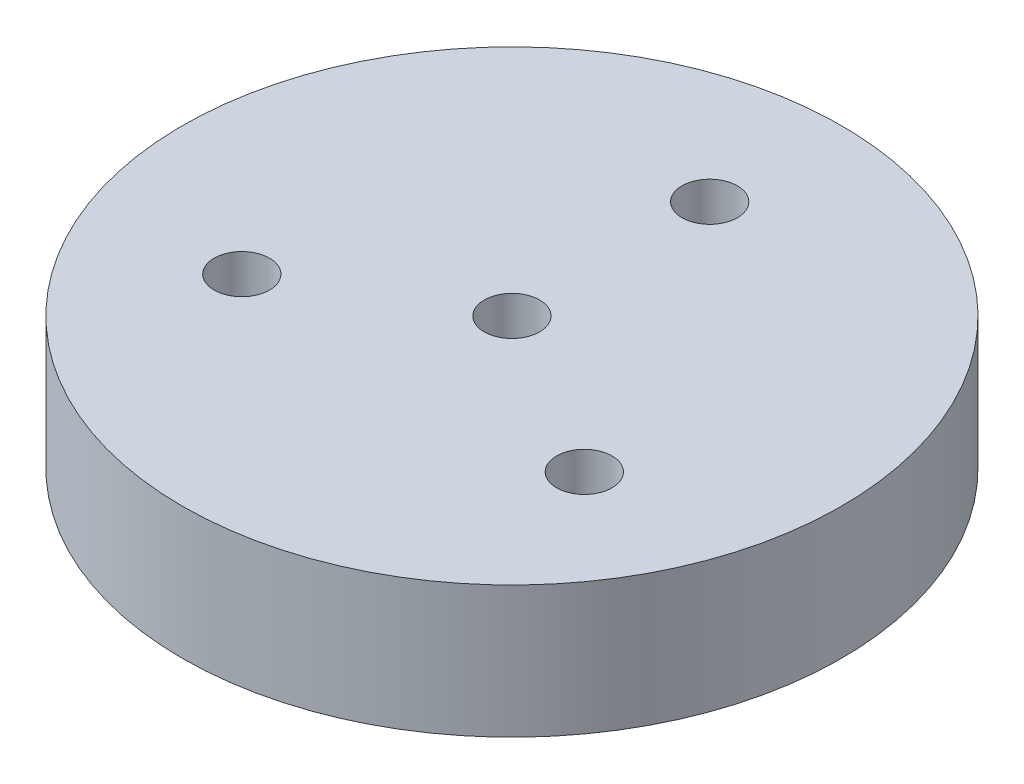
ISO-10303-21;
HEADER;
FILE_DESCRIPTION(('STEP AP214'),'2;1');
FILE_NAME('part.step','',(''),(''),'','','');
FILE_SCHEMA(('AUTOMOTIVE_DESIGN { 1 0 10303 214 1 1 1 1 }'));
ENDSEC;
DATA;
#1=APPLICATION_CONTEXT('core data for automotive mechanical design processes');
#2=APPLICATION_PROTOCOL_DEFINITION('international standard','automotive_design',2000,#1);
#3=PRODUCT_CONTEXT('',#1,'mechanical');
#4=PRODUCT('Part','Part','',(#3));
#5=PRODUCT_RELATED_PRODUCT_CATEGORY('part','',(#4));
#6=PRODUCT_DEFINITION_FORMATION('','',#4);
#7=PRODUCT_DEFINITION_CONTEXT('part definition',#1,'design');
#8=PRODUCT_DEFINITION('design','',#6,#7);
#9=PRODUCT_DEFINITION_SHAPE('','',#8);
#10=(LENGTH_UNIT() NAMED_UNIT(*) SI_UNIT(.MILLI.,.METRE.));
#11=(NAMED_UNIT(*) PLANE_ANGLE_UNIT() SI_UNIT($,.RADIAN.));
#12=(NAMED_UNIT(*) SI_UNIT($,.STERADIAN.) SOLID_ANGLE_UNIT());
#13=UNCERTAINTY_MEASURE_WITH_UNIT(LENGTH_MEASURE(1.E-05),#10,'distance_accuracy_value','');
#14=(GEOMETRIC_REPRESENTATION_CONTEXT(3) GLOBAL_UNCERTAINTY_ASSIGNED_CONTEXT((#13)) GLOBAL_UNIT_ASSIGNED_CONTEXT((#10,
#11,#12)) REPRESENTATION_CONTEXT('',''));
#15=CARTESIAN_POINT('',(0.,0.,0.));
#16=DIRECTION('',(0.,0.,1.));
#17=DIRECTION('',(1.,0.,0.));
#18=AXIS2_PLACEMENT_3D('',#15,#16,#17);
#19=CARTESIAN_POINT('',(0.,10.,0.));
#20=DIRECTION('',(0.,-1.,0.));
#21=DIRECTION('',(0.,0.,-1.));
#22=AXIS2_PLACEMENT_3D('',#19,#20,#21);
#23=CYLINDRICAL_SURFACE('',#22,25.);
#24=CARTESIAN_POINT('',(0.,10.,0.));
#25=DIRECTION('',(0.,1.,0.));
#26=DIRECTION('',(0.,0.,1.));
#27=AXIS2_PLACEMENT_3D('',#24,#25,#26);
#28=CIRCLE('',#27,25.);
#29=CARTESIAN_POINT('',(0.,10.,25.));
#30=VERTEX_POINT('',#29);
#31=EDGE_CURVE('E11',#30,#30,#28,.T.);
#32=ORIENTED_EDGE('',*,*,#31,.F.);
#33=EDGE_LOOP('',(#32));
#34=FACE_BOUND('',#33,.T.);
#35=CARTESIAN_POINT('',(0.,0.,0.));
#36=DIRECTION('',(0.,1.,0.));
#37=DIRECTION('',(0.,0.,1.));
#38=AXIS2_PLACEMENT_3D('',#35,#36,#37);
#39=CIRCLE('',#38,25.);
#40=CARTESIAN_POINT('',(0.,0.,25.));
#41=VERTEX_POINT('',#40);
#42=EDGE_CURVE('E20',#41,#41,#39,.T.);
#43=ORIENTED_EDGE('',*,*,#42,.T.);
#44=EDGE_LOOP('',(#43));
#45=FACE_BOUND('',#44,.T.);
#46=ADVANCED_FACE('F17',(#34,#45),#23,.T.);
#47=CARTESIAN_POINT('',(0.,10.,0.));
#48=DIRECTION('',(0.,1.,0.));
#49=DIRECTION('',(0.,0.,1.));
#50=AXIS2_PLACEMENT_3D('',#47,#48,#49);
#51=PLANE('',#50);
#52=CARTESIAN_POINT('',(0.,10.,0.));
#53=DIRECTION('',(0.,-1.,0.));
#54=DIRECTION('',(0.,0.,-1.));
#55=AXIS2_PLACEMENT_3D('',#52,#53,#54);
#56=CIRCLE('',#55,2.1);
#57=CARTESIAN_POINT('',(0.,10.,-2.1));
#58=VERTEX_POINT('',#57);
#59=EDGE_CURVE('E51',#58,#58,#56,.T.);
#60=ORIENTED_EDGE('',*,*,#59,.T.);
#61=EDGE_LOOP('',(#60));
#62=FACE_BOUND('',#61,.T.);
#63=CARTESIAN_POINT('',(-12.9903810567666,10.,7.49999999999988));
#64=DIRECTION('',(0.,1.,0.));
#65=DIRECTION('',(0.,0.,1.));
#66=AXIS2_PLACEMENT_3D('',#63,#64,#65);
#67=CIRCLE('',#66,2.1);
#68=CARTESIAN_POINT('',(-12.9903810567666,10.,9.59999999999988));
#69=VERTEX_POINT('',#68);
#70=EDGE_CURVE('E45',#69,#69,#67,.T.);
#71=ORIENTED_EDGE('',*,*,#70,.F.);
#72=EDGE_LOOP('',(#71));
#73=FACE_BOUND('',#72,.T.);
#74=CARTESIAN_POINT('',(12.9903810567665,10.,7.5));
#75=DIRECTION('',(0.,1.,0.));
#76=DIRECTION('',(0.,0.,1.));
#77=AXIS2_PLACEMENT_3D('',#74,#75,#76);
#78=CIRCLE('',#77,2.1);
#79=CARTESIAN_POINT('',(12.9903810567665,10.,9.6));
#80=VERTEX_POINT('',#79);
#81=EDGE_CURVE('E44',#80,#80,#78,.T.);
#82=ORIENTED_EDGE('',*,*,#81,.F.);
#83=EDGE_LOOP('',(#82));
#84=FACE_BOUND('',#83,.T.);
#85=CARTESIAN_POINT('',(0.,10.,-15.));
#86=DIRECTION('',(0.,1.,0.));
#87=DIRECTION('',(0.,0.,1.));
#88=AXIS2_PLACEMENT_3D('',#85,#86,#87);
#89=CIRCLE('',#88,2.1);
#90=CARTESIAN_POINT('',(0.,10.,-12.9));
#91=VERTEX_POINT('',#90);
#92=EDGE_CURVE('E57',#91,#91,#89,.T.);
#93=ORIENTED_EDGE('',*,*,#92,.F.);
#94=EDGE_LOOP('',(#93));
#95=FACE_BOUND('',#94,.T.);
#96=ORIENTED_EDGE('',*,*,#31,.T.);
#97=EDGE_LOOP('',(#96));
#98=FACE_BOUND('',#97,.T.);
#99=ADVANCED_FACE('F71',(#62,#73,#84,#95,#98),#51,.T.);
#100=CARTESIAN_POINT('',(0.,0.,0.));
#101=DIRECTION('',(0.,1.,0.));
#102=DIRECTION('',(0.,0.,1.));
#103=AXIS2_PLACEMENT_3D('',#100,#101,#102);
#104=PLANE('',#103);
#105=CARTESIAN_POINT('',(0.,0.,0.));
#106=DIRECTION('',(0.,-1.,0.));
#107=DIRECTION('',(0.,0.,-1.));
#108=AXIS2_PLACEMENT_3D('',#105,#106,#107);
#109=CIRCLE('',#108,2.1);
#110=CARTESIAN_POINT('',(0.,0.,-2.1));
#111=VERTEX_POINT('',#110);
#112=EDGE_CURVE('E174',#111,#111,#109,.T.);
#113=ORIENTED_EDGE('',*,*,#112,.F.);
#114=EDGE_LOOP('',(#113));
#115=FACE_BOUND('',#114,.T.);
#116=ORIENTED_EDGE('',*,*,#42,.F.);
#117=EDGE_LOOP('',(#116));
#118=FACE_BOUND('',#117,.T.);
#119=ADVANCED_FACE('F68',(#115,#118),#104,.F.);
#120=CARTESIAN_POINT('',(0.,2.26180729995788,-15.));
#121=DIRECTION('',(0.,1.,0.));
#122=DIRECTION('',(0.,0.,1.));
#123=AXIS2_PLACEMENT_3D('',#120,#121,#122);
#124=CONICAL_SURFACE('',#123,2.1,1.02974425867665);
#125=CARTESIAN_POINT('',(0.,1.,-15.));
#126=VERTEX_POINT('',#125);
#127=VERTEX_LOOP('',#126);
#128=FACE_BOUND('',#127,.T.);
#129=CARTESIAN_POINT('',(0.,2.26180729995788,-15.));
#130=DIRECTION('',(0.,1.,0.));
#131=DIRECTION('',(0.,0.,1.));
#132=AXIS2_PLACEMENT_3D('',#129,#130,#131);
#133=CIRCLE('',#132,2.1);
#134=CARTESIAN_POINT('',(0.,2.26180729995788,-12.9));
#135=VERTEX_POINT('',#134);
#136=EDGE_CURVE('E60',#135,#135,#133,.T.);
#137=ORIENTED_EDGE('',*,*,#136,.T.);
#138=EDGE_LOOP('',(#137));
#139=FACE_BOUND('',#138,.T.);
#140=ADVANCED_FACE('F70',(#128,#139),#124,.F.);
#141=CARTESIAN_POINT('',(0.,10.,-15.));
#142=DIRECTION('',(0.,1.,0.));
#143=DIRECTION('',(0.,0.,1.));
#144=AXIS2_PLACEMENT_3D('',#141,#142,#143);
#145=CYLINDRICAL_SURFACE('',#144,2.1);
#146=ORIENTED_EDGE('',*,*,#136,.F.);
#147=EDGE_LOOP('',(#146));
#148=FACE_BOUND('',#147,.T.);
#149=ORIENTED_EDGE('',*,*,#92,.T.);
#150=EDGE_LOOP('',(#149));
#151=FACE_BOUND('',#150,.T.);
#152=ADVANCED_FACE('F79',(#148,#151),#145,.F.);
#153=CARTESIAN_POINT('',(12.9903810567665,2.26180729995788,7.5));
#154=DIRECTION('',(0.,1.,0.));
#155=DIRECTION('',(0.,0.,1.));
#156=AXIS2_PLACEMENT_3D('',#153,#154,#155);
#157=CONICAL_SURFACE('',#156,2.1,1.02974425867665);
#158=CARTESIAN_POINT('',(12.9903810567665,1.,7.5));
#159=VERTEX_POINT('',#158);
#160=VERTEX_LOOP('',#159);
#161=FACE_BOUND('',#160,.T.);
#162=CARTESIAN_POINT('',(12.9903810567665,2.26180729995788,7.5));
#163=DIRECTION('',(0.,1.,0.));
#164=DIRECTION('',(0.,0.,1.));
#165=AXIS2_PLACEMENT_3D('',#162,#163,#164);
#166=CIRCLE('',#165,2.1);
#167=CARTESIAN_POINT('',(12.9903810567665,2.26180729995788,9.6));
#168=VERTEX_POINT('',#167);
#169=EDGE_CURVE('E48',#168,#168,#166,.T.);
#170=ORIENTED_EDGE('',*,*,#169,.T.);
#171=EDGE_LOOP('',(#170));
#172=FACE_BOUND('',#171,.T.);
#173=ADVANCED_FACE('F119',(#161,#172),#157,.F.);
#174=CARTESIAN_POINT('',(12.9903810567665,10.,7.5));
#175=DIRECTION('',(0.,1.,0.));
#176=DIRECTION('',(0.,0.,1.));
#177=AXIS2_PLACEMENT_3D('',#174,#175,#176);
#178=CYLINDRICAL_SURFACE('',#177,2.1);
#179=ORIENTED_EDGE('',*,*,#169,.F.);
#180=EDGE_LOOP('',(#179));
#181=FACE_BOUND('',#180,.T.);
#182=ORIENTED_EDGE('',*,*,#81,.T.);
#183=EDGE_LOOP('',(#182));
#184=FACE_BOUND('',#183,.T.);
#185=ADVANCED_FACE('F38',(#181,#184),#178,.F.);
#186=CARTESIAN_POINT('',(-12.9903810567666,2.26180729995788,7.49999999999988));
#187=DIRECTION('',(0.,1.,0.));
#188=DIRECTION('',(0.,0.,1.));
#189=AXIS2_PLACEMENT_3D('',#186,#187,#188);
#190=CONICAL_SURFACE('',#189,2.1,1.02974425867665);
#191=CARTESIAN_POINT('',(-12.9903810567666,1.,7.49999999999988));
#192=VERTEX_POINT('',#191);
#193=VERTEX_LOOP('',#192);
#194=FACE_BOUND('',#193,.T.);
#195=CARTESIAN_POINT('',(-12.9903810567666,2.26180729995788,7.49999999999988));
#196=DIRECTION('',(0.,1.,0.));
#197=DIRECTION('',(0.,0.,1.));
#198=AXIS2_PLACEMENT_3D('',#195,#196,#197);
#199=CIRCLE('',#198,2.1);
#200=CARTESIAN_POINT('',(-12.9903810567666,2.26180729995788,9.59999999999988));
#201=VERTEX_POINT('',#200);
#202=EDGE_CURVE('E42',#201,#201,#199,.T.);
#203=ORIENTED_EDGE('',*,*,#202,.T.);
#204=EDGE_LOOP('',(#203));
#205=FACE_BOUND('',#204,.T.);
#206=ADVANCED_FACE('F34',(#194,#205),#190,.F.);
#207=CARTESIAN_POINT('',(-12.9903810567666,10.,7.49999999999988));
#208=DIRECTION('',(0.,1.,0.));
#209=DIRECTION('',(0.,0.,1.));
#210=AXIS2_PLACEMENT_3D('',#207,#208,#209);
#211=CYLINDRICAL_SURFACE('',#210,2.1);
#212=ORIENTED_EDGE('',*,*,#202,.F.);
#213=EDGE_LOOP('',(#212));
#214=FACE_BOUND('',#213,.T.);
#215=ORIENTED_EDGE('',*,*,#70,.T.);
#216=EDGE_LOOP('',(#215));
#217=FACE_BOUND('',#216,.T.);
#218=ADVANCED_FACE('F37',(#214,#217),#211,.F.);
#219=CARTESIAN_POINT('',(0.,0.,0.));
#220=DIRECTION('',(0.,-1.,0.));
#221=DIRECTION('',(0.,0.,-1.));
#222=AXIS2_PLACEMENT_3D('',#219,#220,#221);
#223=CYLINDRICAL_SURFACE('',#222,2.1);
#224=ORIENTED_EDGE('',*,*,#59,.F.);
#225=EDGE_LOOP('',(#224));
#226=FACE_BOUND('',#225,.T.);
#227=ORIENTED_EDGE('',*,*,#112,.T.);
#228=EDGE_LOOP('',(#227));
#229=FACE_BOUND('',#228,.T.);
#230=ADVANCED_FACE('F153',(#226,#229),#223,.F.);
#231=CLOSED_SHELL('',(#46,#99,#119,#140,#152,#173,#185,#206,#218,#230));
#232=MANIFOLD_SOLID_BREP('B1',#231);
#233=ADVANCED_BREP_SHAPE_REPRESENTATION('',(#18,#232),#14);
#234=SHAPE_DEFINITION_REPRESENTATION(#9,#233);
ENDSEC;
END-ISO-10303-21;
